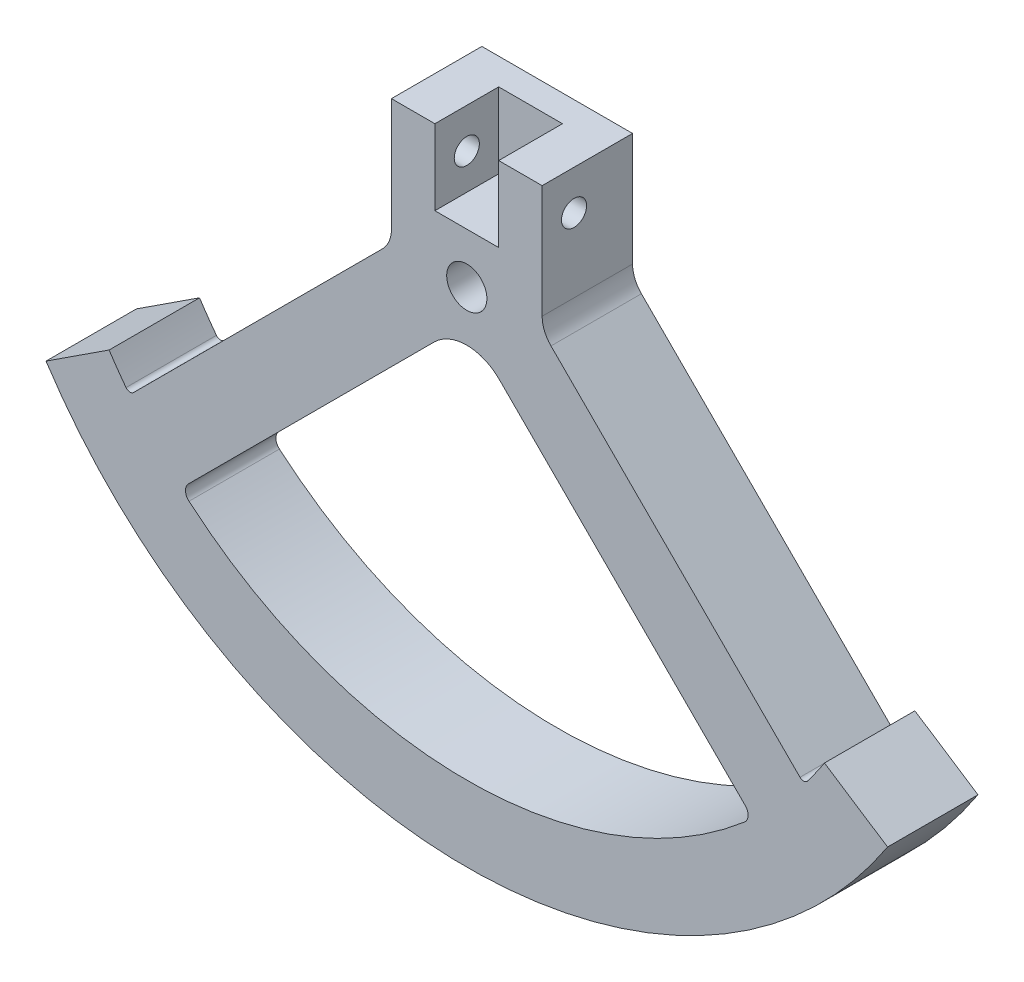
ISO-10303-21;
HEADER;
FILE_DESCRIPTION(('STEP AP214'),'2;1');
FILE_NAME('part.step','',(''),(''),'','','');
FILE_SCHEMA(('AUTOMOTIVE_DESIGN { 1 0 10303 214 1 1 1 1 }'));
ENDSEC;
DATA;
#1=APPLICATION_CONTEXT('core data for automotive mechanical design processes');
#2=APPLICATION_PROTOCOL_DEFINITION('international standard','automotive_design',2000,#1);
#3=PRODUCT_CONTEXT('',#1,'mechanical');
#4=PRODUCT('Part','Part','',(#3));
#5=PRODUCT_RELATED_PRODUCT_CATEGORY('part','',(#4));
#6=PRODUCT_DEFINITION_FORMATION('','',#4);
#7=PRODUCT_DEFINITION_CONTEXT('part definition',#1,'design');
#8=PRODUCT_DEFINITION('design','',#6,#7);
#9=PRODUCT_DEFINITION_SHAPE('','',#8);
#10=(LENGTH_UNIT() NAMED_UNIT(*) SI_UNIT(.MILLI.,.METRE.));
#11=(NAMED_UNIT(*) PLANE_ANGLE_UNIT() SI_UNIT($,.RADIAN.));
#12=(NAMED_UNIT(*) SI_UNIT($,.STERADIAN.) SOLID_ANGLE_UNIT());
#13=UNCERTAINTY_MEASURE_WITH_UNIT(LENGTH_MEASURE(1.E-05),#10,'distance_accuracy_value','');
#14=(GEOMETRIC_REPRESENTATION_CONTEXT(3) GLOBAL_UNCERTAINTY_ASSIGNED_CONTEXT((#13)) GLOBAL_UNIT_ASSIGNED_CONTEXT((#10,
#11,#12)) REPRESENTATION_CONTEXT('',''));
#15=CARTESIAN_POINT('',(0.,0.,0.));
#16=DIRECTION('',(0.,0.,1.));
#17=DIRECTION('',(1.,0.,0.));
#18=AXIS2_PLACEMENT_3D('',#15,#16,#17);
#19=CARTESIAN_POINT('',(0.,0.,18.));
#20=DIRECTION('',(0.,0.,1.));
#21=DIRECTION('',(1.,0.,0.));
#22=AXIS2_PLACEMENT_3D('',#19,#20,#21);
#23=PLANE('',#22);
#24=DIRECTION('',(0.,1.,0.));
#25=VECTOR('',#24,1.);
#26=CARTESIAN_POINT('',(-6.35,10.,18.));
#27=LINE('',#26,#25);
#28=CARTESIAN_POINT('',(-6.35,10.,18.));
#29=VERTEX_POINT('',#28);
#30=CARTESIAN_POINT('',(-6.35,25.,18.));
#31=VERTEX_POINT('',#30);
#32=EDGE_CURVE('E196',#29,#31,#27,.T.);
#33=ORIENTED_EDGE('',*,*,#32,.T.);
#34=DIRECTION('',(-1.,0.,0.));
#35=VECTOR('',#34,1.);
#36=CARTESIAN_POINT('',(15.,25.,18.));
#37=LINE('',#36,#35);
#38=CARTESIAN_POINT('',(-15.,25.,18.));
#39=VERTEX_POINT('',#38);
#40=EDGE_CURVE('E311',#31,#39,#37,.T.);
#41=ORIENTED_EDGE('',*,*,#40,.T.);
#42=DIRECTION('',(0.,-1.,0.));
#43=VECTOR('',#42,1.);
#44=CARTESIAN_POINT('',(-15.,25.,18.));
#45=LINE('',#44,#43);
#46=CARTESIAN_POINT('',(-15.,2.48528137423858,18.));
#47=VERTEX_POINT('',#46);
#48=EDGE_CURVE('E290',#39,#47,#45,.T.);
#49=ORIENTED_EDGE('',*,*,#48,.T.);
#50=CARTESIAN_POINT('',(-21.,2.48528137423858,18.));
#51=DIRECTION('',(0.,0.,1.));
#52=DIRECTION('',(1.,0.,0.));
#53=AXIS2_PLACEMENT_3D('',#50,#51,#52);
#54=CIRCLE('',#53,6.);
#55=CARTESIAN_POINT('',(-16.7573593128807,-1.75735931288072,18.));
#56=VERTEX_POINT('',#55);
#57=EDGE_CURVE('E387',#47,#56,#54,.F.);
#58=ORIENTED_EDGE('',*,*,#57,.T.);
#59=DIRECTION('',(-0.707106781186548,-0.707106781186547,0.));
#60=VECTOR('',#59,1.);
#61=CARTESIAN_POINT('',(-15.,0.,18.));
#62=LINE('',#61,#60);
#63=CARTESIAN_POINT('',(-66.3272334746604,-51.3272334746603,18.));
#64=VERTEX_POINT('',#63);
#65=EDGE_CURVE('E293',#56,#64,#62,.T.);
#66=ORIENTED_EDGE('',*,*,#65,.T.);
#67=CARTESIAN_POINT('',(-67.034340255847,-50.6201266934738,18.));
#68=DIRECTION('',(0.,0.,1.));
#69=DIRECTION('',(1.,0.,0.));
#70=AXIS2_PLACEMENT_3D('',#67,#68,#69);
#71=CIRCLE('',#70,1.);
#72=CARTESIAN_POINT('',(-67.8323681160356,-51.2227472493485,18.));
#73=VERTEX_POINT('',#72);
#74=EDGE_CURVE('E374',#64,#73,#71,.F.);
#75=ORIENTED_EDGE('',*,*,#74,.T.);
#76=CARTESIAN_POINT('',(0.,0.,18.));
#77=DIRECTION('',(0.,0.,-1.));
#78=DIRECTION('',(1.,0.,0.));
#79=AXIS2_PLACEMENT_3D('',#76,#77,#78);
#80=CIRCLE('',#79,85.);
#81=CARTESIAN_POINT('',(-71.1964213926211,-46.4334963241444,18.));
#82=VERTEX_POINT('',#81);
#83=EDGE_CURVE('E296',#73,#82,#80,.T.);
#84=ORIENTED_EDGE('',*,*,#83,.T.);
#85=DIRECTION('',(-0.837604957560248,-0.546276427342875,0.));
#86=VECTOR('',#85,1.);
#87=CARTESIAN_POINT('',(-83.7604957560248,-54.6276427342875,18.));
#88=LINE('',#87,#86);
#89=CARTESIAN_POINT('',(-83.7604957560248,-54.6276427342875,18.));
#90=VERTEX_POINT('',#89);
#91=EDGE_CURVE('E298',#82,#90,#88,.T.);
#92=ORIENTED_EDGE('',*,*,#91,.T.);
#93=CARTESIAN_POINT('',(0.,0.,18.));
#94=DIRECTION('',(0.,0.,1.));
#95=DIRECTION('',(1.,0.,0.));
#96=AXIS2_PLACEMENT_3D('',#93,#94,#95);
#97=CIRCLE('',#96,100.);
#98=CARTESIAN_POINT('',(83.7604957560248,-54.6276427342875,18.));
#99=VERTEX_POINT('',#98);
#100=EDGE_CURVE('E300',#90,#99,#97,.T.);
#101=ORIENTED_EDGE('',*,*,#100,.T.);
#102=DIRECTION('',(-0.837604957560248,0.546276427342875,0.));
#103=VECTOR('',#102,1.);
#104=CARTESIAN_POINT('',(83.7604957560248,-54.6276427342875,18.));
#105=LINE('',#104,#103);
#106=CARTESIAN_POINT('',(71.1964213926211,-46.4334963241444,18.));
#107=VERTEX_POINT('',#106);
#108=EDGE_CURVE('E302',#99,#107,#105,.T.);
#109=ORIENTED_EDGE('',*,*,#108,.T.);
#110=CARTESIAN_POINT('',(0.,0.,18.));
#111=DIRECTION('',(0.,0.,-1.));
#112=DIRECTION('',(-1.,0.,0.));
#113=AXIS2_PLACEMENT_3D('',#110,#111,#112);
#114=CIRCLE('',#113,85.);
#115=CARTESIAN_POINT('',(67.8323681160357,-51.2227472493484,18.));
#116=VERTEX_POINT('',#115);
#117=EDGE_CURVE('E304',#107,#116,#114,.T.);
#118=ORIENTED_EDGE('',*,*,#117,.T.);
#119=CARTESIAN_POINT('',(67.034340255847,-50.6201266934738,18.));
#120=DIRECTION('',(0.,0.,1.));
#121=DIRECTION('',(1.,0.,0.));
#122=AXIS2_PLACEMENT_3D('',#119,#120,#121);
#123=CIRCLE('',#122,1.);
#124=CARTESIAN_POINT('',(66.3272334746604,-51.3272334746603,18.));
#125=VERTEX_POINT('',#124);
#126=EDGE_CURVE('E369',#116,#125,#123,.F.);
#127=ORIENTED_EDGE('',*,*,#126,.T.);
#128=DIRECTION('',(-0.707106781186548,0.707106781186547,0.));
#129=VECTOR('',#128,1.);
#130=CARTESIAN_POINT('',(15.,0.,18.));
#131=LINE('',#130,#129);
#132=CARTESIAN_POINT('',(16.7573593128807,-1.75735931288071,18.));
#133=VERTEX_POINT('',#132);
#134=EDGE_CURVE('E307',#125,#133,#131,.T.);
#135=ORIENTED_EDGE('',*,*,#134,.T.);
#136=CARTESIAN_POINT('',(21.,2.48528137423858,18.));
#137=DIRECTION('',(0.,0.,1.));
#138=DIRECTION('',(1.,0.,0.));
#139=AXIS2_PLACEMENT_3D('',#136,#137,#138);
#140=CIRCLE('',#139,6.);
#141=CARTESIAN_POINT('',(15.,2.48528137423858,18.));
#142=VERTEX_POINT('',#141);
#143=EDGE_CURVE('E11',#133,#142,#140,.F.);
#144=ORIENTED_EDGE('',*,*,#143,.T.);
#145=DIRECTION('',(0.,1.,0.));
#146=VECTOR('',#145,1.);
#147=CARTESIAN_POINT('',(15.,25.,18.));
#148=LINE('',#147,#146);
#149=CARTESIAN_POINT('',(15.,25.,18.));
#150=VERTEX_POINT('',#149);
#151=EDGE_CURVE('E309',#142,#150,#148,.T.);
#152=ORIENTED_EDGE('',*,*,#151,.T.);
#153=CARTESIAN_POINT('',(6.35,25.,18.));
#154=VERTEX_POINT('',#153);
#155=EDGE_CURVE('E312',#150,#154,#37,.T.);
#156=ORIENTED_EDGE('',*,*,#155,.T.);
#157=DIRECTION('',(0.,1.,0.));
#158=VECTOR('',#157,1.);
#159=CARTESIAN_POINT('',(6.35,10.,18.));
#160=LINE('',#159,#158);
#161=CARTESIAN_POINT('',(6.35,10.,18.));
#162=VERTEX_POINT('',#161);
#163=EDGE_CURVE('E206',#162,#154,#160,.T.);
#164=ORIENTED_EDGE('',*,*,#163,.F.);
#165=DIRECTION('',(1.,0.,0.));
#166=VECTOR('',#165,1.);
#167=CARTESIAN_POINT('',(6.35,10.,18.));
#168=LINE('',#167,#166);
#169=EDGE_CURVE('E213',#29,#162,#168,.T.);
#170=ORIENTED_EDGE('',*,*,#169,.F.);
#171=EDGE_LOOP('',(#33,#41,#49,#58,#66,#75,#84,#92,#101,#109,#118,#127,#135,#144,#152,#156,#164,#170));
#172=FACE_BOUND('',#171,.T.);
#173=CARTESIAN_POINT('',(0.,0.,18.));
#174=DIRECTION('',(0.,0.,1.));
#175=DIRECTION('',(1.,0.,0.));
#176=AXIS2_PLACEMENT_3D('',#173,#174,#175);
#177=CIRCLE('',#176,4.);
#178=CARTESIAN_POINT('',(4.,0.,18.));
#179=VERTEX_POINT('',#178);
#180=EDGE_CURVE('E284',#179,#179,#177,.T.);
#181=ORIENTED_EDGE('',*,*,#180,.F.);
#182=EDGE_LOOP('',(#181));
#183=FACE_BOUND('',#182,.T.);
#184=DIRECTION('',(-0.707106781186548,-0.707106781186546,0.));
#185=VECTOR('',#184,1.);
#186=CARTESIAN_POINT('',(-55.4088853706861,-61.6220888062824,18.));
#187=LINE('',#186,#185);
#188=CARTESIAN_POINT('',(-6.46446609406721,-12.6776695296637,18.));
#189=VERTEX_POINT('',#188);
#190=CARTESIAN_POINT('',(-55.4088853706861,-61.6220888062824,18.));
#191=VERTEX_POINT('',#190);
#192=EDGE_CURVE('E241',#189,#191,#187,.T.);
#193=ORIENTED_EDGE('',*,*,#192,.F.);
#194=CARTESIAN_POINT('',(0.,-19.1421356237309,18.));
#195=DIRECTION('',(0.,0.,1.));
#196=DIRECTION('',(-1.,0.,0.));
#197=AXIS2_PLACEMENT_3D('',#194,#195,#196);
#198=CIRCLE('',#197,9.1421356237309);
#199=CARTESIAN_POINT('',(6.46446609406723,-12.6776695296637,18.));
#200=VERTEX_POINT('',#199);
#201=EDGE_CURVE('E239',#200,#189,#198,.T.);
#202=ORIENTED_EDGE('',*,*,#201,.F.);
#203=DIRECTION('',(-0.707106781186549,0.707106781186546,0.));
#204=VECTOR('',#203,1.);
#205=CARTESIAN_POINT('',(55.4088853706861,-61.6220888062824,18.));
#206=LINE('',#205,#204);
#207=CARTESIAN_POINT('',(55.4088853706861,-61.6220888062824,18.));
#208=VERTEX_POINT('',#207);
#209=EDGE_CURVE('E251',#208,#200,#206,.T.);
#210=ORIENTED_EDGE('',*,*,#209,.F.);
#211=CARTESIAN_POINT('',(53.9946718083131,-63.0363023686555,18.));
#212=DIRECTION('',(0.,0.,1.));
#213=DIRECTION('',(1.,0.,0.));
#214=AXIS2_PLACEMENT_3D('',#211,#212,#213);
#215=CIRCLE('',#214,1.99999999999999);
#216=CARTESIAN_POINT('',(55.2957482374291,-64.5552494136833,18.));
#217=VERTEX_POINT('',#216);
#218=EDGE_CURVE('E248',#217,#208,#215,.T.);
#219=ORIENTED_EDGE('',*,*,#218,.F.);
#220=CARTESIAN_POINT('',(0.,0.,18.));
#221=DIRECTION('',(0.,0.,1.));
#222=DIRECTION('',(-1.,0.,0.));
#223=AXIS2_PLACEMENT_3D('',#220,#221,#222);
#224=CIRCLE('',#223,85.);
#225=CARTESIAN_POINT('',(-55.295748237429,-64.5552494136833,18.));
#226=VERTEX_POINT('',#225);
#227=EDGE_CURVE('E246',#226,#217,#224,.T.);
#228=ORIENTED_EDGE('',*,*,#227,.F.);
#229=CARTESIAN_POINT('',(-53.994671808313,-63.0363023686555,18.));
#230=DIRECTION('',(0.,0.,1.));
#231=DIRECTION('',(-1.,0.,0.));
#232=AXIS2_PLACEMENT_3D('',#229,#230,#231);
#233=CIRCLE('',#232,1.99999999999999);
#234=EDGE_CURVE('E244',#191,#226,#233,.T.);
#235=ORIENTED_EDGE('',*,*,#234,.F.);
#236=EDGE_LOOP('',(#193,#202,#210,#219,#228,#235));
#237=FACE_BOUND('',#236,.T.);
#238=ADVANCED_FACE('F35',(#172,#183,#237),#23,.T.);
#239=CARTESIAN_POINT('',(0.,0.,0.));
#240=DIRECTION('',(0.,0.,1.));
#241=DIRECTION('',(1.,0.,0.));
#242=AXIS2_PLACEMENT_3D('',#239,#240,#241);
#243=PLANE('',#242);
#244=CARTESIAN_POINT('',(0.,0.,0.));
#245=DIRECTION('',(0.,0.,1.));
#246=DIRECTION('',(1.,0.,0.));
#247=AXIS2_PLACEMENT_3D('',#244,#245,#246);
#248=CIRCLE('',#247,4.);
#249=CARTESIAN_POINT('',(4.,0.,0.));
#250=VERTEX_POINT('',#249);
#251=EDGE_CURVE('E283',#250,#250,#248,.T.);
#252=ORIENTED_EDGE('',*,*,#251,.T.);
#253=EDGE_LOOP('',(#252));
#254=FACE_BOUND('',#253,.T.);
#255=DIRECTION('',(0.,-1.,0.));
#256=VECTOR('',#255,1.);
#257=CARTESIAN_POINT('',(-15.,25.,0.));
#258=LINE('',#257,#256);
#259=CARTESIAN_POINT('',(-15.,25.,0.));
#260=VERTEX_POINT('',#259);
#261=CARTESIAN_POINT('',(-15.,2.48528137423858,0.));
#262=VERTEX_POINT('',#261);
#263=EDGE_CURVE('E287',#260,#262,#258,.T.);
#264=ORIENTED_EDGE('',*,*,#263,.F.);
#265=DIRECTION('',(-1.,0.,0.));
#266=VECTOR('',#265,1.);
#267=CARTESIAN_POINT('',(15.,25.,0.));
#268=LINE('',#267,#266);
#269=CARTESIAN_POINT('',(15.,25.,0.));
#270=VERTEX_POINT('',#269);
#271=EDGE_CURVE('E294',#270,#260,#268,.T.);
#272=ORIENTED_EDGE('',*,*,#271,.F.);
#273=DIRECTION('',(0.,1.,0.));
#274=VECTOR('',#273,1.);
#275=CARTESIAN_POINT('',(15.,25.,0.));
#276=LINE('',#275,#274);
#277=CARTESIAN_POINT('',(15.,2.48528137423858,0.));
#278=VERTEX_POINT('',#277);
#279=EDGE_CURVE('E332',#278,#270,#276,.T.);
#280=ORIENTED_EDGE('',*,*,#279,.F.);
#281=CARTESIAN_POINT('',(21.,2.48528137423858,0.));
#282=DIRECTION('',(0.,0.,1.));
#283=DIRECTION('',(1.,0.,0.));
#284=AXIS2_PLACEMENT_3D('',#281,#282,#283);
#285=CIRCLE('',#284,6.);
#286=CARTESIAN_POINT('',(16.7573593128807,-1.75735931288071,0.));
#287=VERTEX_POINT('',#286);
#288=EDGE_CURVE('E43',#278,#287,#285,.T.);
#289=ORIENTED_EDGE('',*,*,#288,.T.);
#290=DIRECTION('',(-0.707106781186548,0.707106781186547,0.));
#291=VECTOR('',#290,1.);
#292=CARTESIAN_POINT('',(15.,0.,0.));
#293=LINE('',#292,#291);
#294=CARTESIAN_POINT('',(66.3272334746604,-51.3272334746603,0.));
#295=VERTEX_POINT('',#294);
#296=EDGE_CURVE('E330',#295,#287,#293,.T.);
#297=ORIENTED_EDGE('',*,*,#296,.F.);
#298=CARTESIAN_POINT('',(67.034340255847,-50.6201266934738,0.));
#299=DIRECTION('',(0.,0.,1.));
#300=DIRECTION('',(1.,0.,0.));
#301=AXIS2_PLACEMENT_3D('',#298,#299,#300);
#302=CIRCLE('',#301,1.);
#303=CARTESIAN_POINT('',(67.8323681160357,-51.2227472493484,0.));
#304=VERTEX_POINT('',#303);
#305=EDGE_CURVE('E367',#295,#304,#302,.T.);
#306=ORIENTED_EDGE('',*,*,#305,.T.);
#307=CARTESIAN_POINT('',(0.,0.,0.));
#308=DIRECTION('',(0.,0.,-1.));
#309=DIRECTION('',(-1.,0.,0.));
#310=AXIS2_PLACEMENT_3D('',#307,#308,#309);
#311=CIRCLE('',#310,85.);
#312=CARTESIAN_POINT('',(71.1964213926211,-46.4334963241444,0.));
#313=VERTEX_POINT('',#312);
#314=EDGE_CURVE('E327',#313,#304,#311,.T.);
#315=ORIENTED_EDGE('',*,*,#314,.F.);
#316=DIRECTION('',(-0.837604957560248,0.546276427342875,0.));
#317=VECTOR('',#316,1.);
#318=CARTESIAN_POINT('',(83.7604957560248,-54.6276427342875,0.));
#319=LINE('',#318,#317);
#320=CARTESIAN_POINT('',(83.7604957560248,-54.6276427342875,0.));
#321=VERTEX_POINT('',#320);
#322=EDGE_CURVE('E325',#321,#313,#319,.T.);
#323=ORIENTED_EDGE('',*,*,#322,.F.);
#324=CARTESIAN_POINT('',(0.,0.,0.));
#325=DIRECTION('',(0.,0.,1.));
#326=DIRECTION('',(1.,0.,0.));
#327=AXIS2_PLACEMENT_3D('',#324,#325,#326);
#328=CIRCLE('',#327,100.);
#329=CARTESIAN_POINT('',(-83.7604957560248,-54.6276427342875,0.));
#330=VERTEX_POINT('',#329);
#331=EDGE_CURVE('E323',#330,#321,#328,.T.);
#332=ORIENTED_EDGE('',*,*,#331,.F.);
#333=DIRECTION('',(-0.837604957560248,-0.546276427342875,0.));
#334=VECTOR('',#333,1.);
#335=CARTESIAN_POINT('',(-83.7604957560248,-54.6276427342875,0.));
#336=LINE('',#335,#334);
#337=CARTESIAN_POINT('',(-71.1964213926211,-46.4334963241444,0.));
#338=VERTEX_POINT('',#337);
#339=EDGE_CURVE('E321',#338,#330,#336,.T.);
#340=ORIENTED_EDGE('',*,*,#339,.F.);
#341=CARTESIAN_POINT('',(0.,0.,0.));
#342=DIRECTION('',(0.,0.,-1.));
#343=DIRECTION('',(1.,0.,0.));
#344=AXIS2_PLACEMENT_3D('',#341,#342,#343);
#345=CIRCLE('',#344,85.);
#346=CARTESIAN_POINT('',(-67.8323681160356,-51.2227472493485,0.));
#347=VERTEX_POINT('',#346);
#348=EDGE_CURVE('E319',#347,#338,#345,.T.);
#349=ORIENTED_EDGE('',*,*,#348,.F.);
#350=CARTESIAN_POINT('',(-67.034340255847,-50.6201266934738,0.));
#351=DIRECTION('',(0.,0.,1.));
#352=DIRECTION('',(1.,0.,0.));
#353=AXIS2_PLACEMENT_3D('',#350,#351,#352);
#354=CIRCLE('',#353,1.);
#355=CARTESIAN_POINT('',(-66.3272334746604,-51.3272334746603,0.));
#356=VERTEX_POINT('',#355);
#357=EDGE_CURVE('E371',#347,#356,#354,.T.);
#358=ORIENTED_EDGE('',*,*,#357,.T.);
#359=DIRECTION('',(-0.707106781186548,-0.707106781186547,0.));
#360=VECTOR('',#359,1.);
#361=CARTESIAN_POINT('',(-15.,0.,0.));
#362=LINE('',#361,#360);
#363=CARTESIAN_POINT('',(-16.7573593128807,-1.75735931288072,0.));
#364=VERTEX_POINT('',#363);
#365=EDGE_CURVE('E317',#364,#356,#362,.T.);
#366=ORIENTED_EDGE('',*,*,#365,.F.);
#367=CARTESIAN_POINT('',(-21.,2.48528137423858,0.));
#368=DIRECTION('',(0.,0.,1.));
#369=DIRECTION('',(1.,0.,0.));
#370=AXIS2_PLACEMENT_3D('',#367,#368,#369);
#371=CIRCLE('',#370,6.);
#372=EDGE_CURVE('E385',#364,#262,#371,.T.);
#373=ORIENTED_EDGE('',*,*,#372,.T.);
#374=EDGE_LOOP('',(#264,#272,#280,#289,#297,#306,#315,#323,#332,#340,#349,#358,#366,#373));
#375=FACE_BOUND('',#374,.T.);
#376=CARTESIAN_POINT('',(0.,-19.1421356237309,0.));
#377=DIRECTION('',(0.,0.,1.));
#378=DIRECTION('',(-1.,0.,0.));
#379=AXIS2_PLACEMENT_3D('',#376,#377,#378);
#380=CIRCLE('',#379,9.1421356237309);
#381=CARTESIAN_POINT('',(6.46446609406724,-12.6776695296637,0.));
#382=VERTEX_POINT('',#381);
#383=CARTESIAN_POINT('',(-6.46446609406721,-12.6776695296637,0.));
#384=VERTEX_POINT('',#383);
#385=EDGE_CURVE('E235',#382,#384,#380,.T.);
#386=ORIENTED_EDGE('',*,*,#385,.T.);
#387=DIRECTION('',(-0.707106781186548,-0.707106781186546,0.));
#388=VECTOR('',#387,1.);
#389=CARTESIAN_POINT('',(-55.4088853706861,-61.6220888062824,0.));
#390=LINE('',#389,#388);
#391=CARTESIAN_POINT('',(-55.4088853706861,-61.6220888062824,0.));
#392=VERTEX_POINT('',#391);
#393=EDGE_CURVE('E256',#384,#392,#390,.T.);
#394=ORIENTED_EDGE('',*,*,#393,.T.);
#395=CARTESIAN_POINT('',(-53.994671808313,-63.0363023686555,0.));
#396=DIRECTION('',(0.,0.,1.));
#397=DIRECTION('',(-1.,0.,0.));
#398=AXIS2_PLACEMENT_3D('',#395,#396,#397);
#399=CIRCLE('',#398,1.99999999999999);
#400=CARTESIAN_POINT('',(-55.295748237429,-64.5552494136833,0.));
#401=VERTEX_POINT('',#400);
#402=EDGE_CURVE('E259',#392,#401,#399,.T.);
#403=ORIENTED_EDGE('',*,*,#402,.T.);
#404=CARTESIAN_POINT('',(0.,0.,0.));
#405=DIRECTION('',(0.,0.,1.));
#406=DIRECTION('',(-1.,0.,0.));
#407=AXIS2_PLACEMENT_3D('',#404,#405,#406);
#408=CIRCLE('',#407,85.);
#409=CARTESIAN_POINT('',(55.2957482374291,-64.5552494136833,0.));
#410=VERTEX_POINT('',#409);
#411=EDGE_CURVE('E262',#401,#410,#408,.T.);
#412=ORIENTED_EDGE('',*,*,#411,.T.);
#413=CARTESIAN_POINT('',(53.9946718083131,-63.0363023686555,0.));
#414=DIRECTION('',(0.,0.,1.));
#415=DIRECTION('',(1.,0.,0.));
#416=AXIS2_PLACEMENT_3D('',#413,#414,#415);
#417=CIRCLE('',#416,1.99999999999999);
#418=CARTESIAN_POINT('',(55.4088853706861,-61.6220888062824,0.));
#419=VERTEX_POINT('',#418);
#420=EDGE_CURVE('E265',#410,#419,#417,.T.);
#421=ORIENTED_EDGE('',*,*,#420,.T.);
#422=DIRECTION('',(-0.707106781186549,0.707106781186546,0.));
#423=VECTOR('',#422,1.);
#424=CARTESIAN_POINT('',(55.4088853706861,-61.6220888062824,0.));
#425=LINE('',#424,#423);
#426=EDGE_CURVE('E242',#419,#382,#425,.T.);
#427=ORIENTED_EDGE('',*,*,#426,.T.);
#428=EDGE_LOOP('',(#386,#394,#403,#412,#421,#427));
#429=FACE_BOUND('',#428,.T.);
#430=ADVANCED_FACE('F401',(#254,#375,#429),#243,.F.);
#431=CARTESIAN_POINT('',(-15.,25.,18.));
#432=DIRECTION('',(1.,0.,0.));
#433=DIRECTION('',(0.,1.,0.));
#434=AXIS2_PLACEMENT_3D('',#431,#432,#433);
#435=PLANE('',#434);
#436=CARTESIAN_POINT('',(-15.,17.125,11.65));
#437=DIRECTION('',(-1.,0.,0.));
#438=DIRECTION('',(0.,0.,1.));
#439=AXIS2_PLACEMENT_3D('',#436,#437,#438);
#440=CIRCLE('',#439,2.5);
#441=CARTESIAN_POINT('',(-15.,17.125,14.15));
#442=VERTEX_POINT('',#441);
#443=EDGE_CURVE('E494',#442,#442,#440,.T.);
#444=ORIENTED_EDGE('',*,*,#443,.F.);
#445=EDGE_LOOP('',(#444));
#446=FACE_BOUND('',#445,.T.);
#447=ORIENTED_EDGE('',*,*,#263,.T.);
#448=DIRECTION('',(0.,0.,-1.));
#449=VECTOR('',#448,1.);
#450=CARTESIAN_POINT('',(-15.,2.48528137423858,18.));
#451=LINE('',#450,#449);
#452=EDGE_CURVE('E379',#262,#47,#451,.F.);
#453=ORIENTED_EDGE('',*,*,#452,.T.);
#454=ORIENTED_EDGE('',*,*,#48,.F.);
#455=DIRECTION('',(0.,0.,-1.));
#456=VECTOR('',#455,1.);
#457=CARTESIAN_POINT('',(-15.,25.,18.));
#458=LINE('',#457,#456);
#459=EDGE_CURVE('E314',#39,#260,#458,.T.);
#460=ORIENTED_EDGE('',*,*,#459,.T.);
#461=EDGE_LOOP('',(#447,#453,#454,#460));
#462=FACE_BOUND('',#461,.T.);
#463=ADVANCED_FACE('F405',(#446,#462),#435,.F.);
#464=CARTESIAN_POINT('',(-15.,0.,18.));
#465=DIRECTION('',(0.707106781186547,-0.707106781186548,0.));
#466=DIRECTION('',(0.707106781186548,0.707106781186547,0.));
#467=AXIS2_PLACEMENT_3D('',#464,#465,#466);
#468=PLANE('',#467);
#469=ORIENTED_EDGE('',*,*,#65,.F.);
#470=DIRECTION('',(0.,0.,-1.));
#471=VECTOR('',#470,1.);
#472=CARTESIAN_POINT('',(-16.7573593128807,-1.75735931288072,0.));
#473=LINE('',#472,#471);
#474=EDGE_CURVE('E376',#56,#364,#473,.T.);
#475=ORIENTED_EDGE('',*,*,#474,.T.);
#476=ORIENTED_EDGE('',*,*,#365,.T.);
#477=DIRECTION('',(0.,0.,1.));
#478=VECTOR('',#477,1.);
#479=CARTESIAN_POINT('',(-66.3272334746604,-51.3272334746603,18.));
#480=LINE('',#479,#478);
#481=EDGE_CURVE('E364',#356,#64,#480,.T.);
#482=ORIENTED_EDGE('',*,*,#481,.T.);
#483=EDGE_LOOP('',(#469,#475,#476,#482));
#484=FACE_BOUND('',#483,.T.);
#485=ADVANCED_FACE('F395',(#484),#468,.F.);
#486=CARTESIAN_POINT('',(0.,0.,18.));
#487=DIRECTION('',(0.,0.,-1.));
#488=DIRECTION('',(-1.,0.,0.));
#489=AXIS2_PLACEMENT_3D('',#486,#487,#488);
#490=CYLINDRICAL_SURFACE('',#489,85.);
#491=ORIENTED_EDGE('',*,*,#83,.F.);
#492=DIRECTION('',(0.,0.,-1.));
#493=VECTOR('',#492,1.);
#494=CARTESIAN_POINT('',(-67.8323681160356,-51.2227472493485,18.));
#495=LINE('',#494,#493);
#496=EDGE_CURVE('E361',#73,#347,#495,.T.);
#497=ORIENTED_EDGE('',*,*,#496,.T.);
#498=ORIENTED_EDGE('',*,*,#348,.T.);
#499=DIRECTION('',(0.,0.,-1.));
#500=VECTOR('',#499,1.);
#501=CARTESIAN_POINT('',(-71.1964213926211,-46.4334963241444,18.));
#502=LINE('',#501,#500);
#503=EDGE_CURVE('E349',#82,#338,#502,.T.);
#504=ORIENTED_EDGE('',*,*,#503,.F.);
#505=EDGE_LOOP('',(#491,#497,#498,#504));
#506=FACE_BOUND('',#505,.T.);
#507=ADVANCED_FACE('F446',(#506),#490,.F.);
#508=CARTESIAN_POINT('',(-83.7604957560248,-54.6276427342875,18.));
#509=DIRECTION('',(0.546276427342875,-0.837604957560248,0.));
#510=DIRECTION('',(0.837604957560248,0.546276427342875,0.));
#511=AXIS2_PLACEMENT_3D('',#508,#509,#510);
#512=PLANE('',#511);
#513=ORIENTED_EDGE('',*,*,#339,.T.);
#514=DIRECTION('',(0.,0.,-1.));
#515=VECTOR('',#514,1.);
#516=CARTESIAN_POINT('',(-83.7604957560248,-54.6276427342875,18.));
#517=LINE('',#516,#515);
#518=EDGE_CURVE('E346',#90,#330,#517,.T.);
#519=ORIENTED_EDGE('',*,*,#518,.F.);
#520=ORIENTED_EDGE('',*,*,#91,.F.);
#521=ORIENTED_EDGE('',*,*,#503,.T.);
#522=EDGE_LOOP('',(#513,#519,#520,#521));
#523=FACE_BOUND('',#522,.T.);
#524=ADVANCED_FACE('F442',(#523),#512,.F.);
#525=CARTESIAN_POINT('',(0.,0.,18.));
#526=DIRECTION('',(0.,0.,-1.));
#527=DIRECTION('',(-1.,0.,0.));
#528=AXIS2_PLACEMENT_3D('',#525,#526,#527);
#529=CYLINDRICAL_SURFACE('',#528,100.);
#530=ORIENTED_EDGE('',*,*,#331,.T.);
#531=DIRECTION('',(0.,0.,-1.));
#532=VECTOR('',#531,1.);
#533=CARTESIAN_POINT('',(83.7604957560248,-54.6276427342875,18.));
#534=LINE('',#533,#532);
#535=EDGE_CURVE('E343',#99,#321,#534,.T.);
#536=ORIENTED_EDGE('',*,*,#535,.F.);
#537=ORIENTED_EDGE('',*,*,#100,.F.);
#538=ORIENTED_EDGE('',*,*,#518,.T.);
#539=EDGE_LOOP('',(#530,#536,#537,#538));
#540=FACE_BOUND('',#539,.T.);
#541=ADVANCED_FACE('F437',(#540),#529,.T.);
#542=CARTESIAN_POINT('',(83.7604957560248,-54.6276427342875,18.));
#543=DIRECTION('',(-0.546276427342875,-0.837604957560248,0.));
#544=DIRECTION('',(0.837604957560248,-0.546276427342875,0.));
#545=AXIS2_PLACEMENT_3D('',#542,#543,#544);
#546=PLANE('',#545);
#547=ORIENTED_EDGE('',*,*,#322,.T.);
#548=DIRECTION('',(0.,0.,-1.));
#549=VECTOR('',#548,1.);
#550=CARTESIAN_POINT('',(71.1964213926211,-46.4334963241444,18.));
#551=LINE('',#550,#549);
#552=EDGE_CURVE('E340',#107,#313,#551,.T.);
#553=ORIENTED_EDGE('',*,*,#552,.F.);
#554=ORIENTED_EDGE('',*,*,#108,.F.);
#555=ORIENTED_EDGE('',*,*,#535,.T.);
#556=EDGE_LOOP('',(#547,#553,#554,#555));
#557=FACE_BOUND('',#556,.T.);
#558=ADVANCED_FACE('F431',(#557),#546,.F.);
#559=CARTESIAN_POINT('',(0.,0.,18.));
#560=DIRECTION('',(0.,0.,-1.));
#561=DIRECTION('',(-1.,0.,0.));
#562=AXIS2_PLACEMENT_3D('',#559,#560,#561);
#563=CYLINDRICAL_SURFACE('',#562,85.);
#564=ORIENTED_EDGE('',*,*,#314,.T.);
#565=DIRECTION('',(0.,0.,-1.));
#566=VECTOR('',#565,1.);
#567=CARTESIAN_POINT('',(67.8323681160357,-51.2227472493484,18.));
#568=LINE('',#567,#566);
#569=EDGE_CURVE('E359',#304,#116,#568,.F.);
#570=ORIENTED_EDGE('',*,*,#569,.T.);
#571=ORIENTED_EDGE('',*,*,#117,.F.);
#572=ORIENTED_EDGE('',*,*,#552,.T.);
#573=EDGE_LOOP('',(#564,#570,#571,#572));
#574=FACE_BOUND('',#573,.T.);
#575=ADVANCED_FACE('F426',(#574),#563,.F.);
#576=CARTESIAN_POINT('',(15.,0.,18.));
#577=DIRECTION('',(-0.707106781186547,-0.707106781186548,0.));
#578=DIRECTION('',(0.707106781186548,-0.707106781186547,0.));
#579=AXIS2_PLACEMENT_3D('',#576,#577,#578);
#580=PLANE('',#579);
#581=ORIENTED_EDGE('',*,*,#296,.T.);
#582=DIRECTION('',(0.,0.,-1.));
#583=VECTOR('',#582,1.);
#584=CARTESIAN_POINT('',(16.7573593128807,-1.75735931288071,18.));
#585=LINE('',#584,#583);
#586=EDGE_CURVE('E56',#287,#133,#585,.F.);
#587=ORIENTED_EDGE('',*,*,#586,.T.);
#588=ORIENTED_EDGE('',*,*,#134,.F.);
#589=DIRECTION('',(0.,0.,1.));
#590=VECTOR('',#589,1.);
#591=CARTESIAN_POINT('',(66.3272334746604,-51.3272334746603,0.));
#592=LINE('',#591,#590);
#593=EDGE_CURVE('E352',#125,#295,#592,.F.);
#594=ORIENTED_EDGE('',*,*,#593,.T.);
#595=EDGE_LOOP('',(#581,#587,#588,#594));
#596=FACE_BOUND('',#595,.T.);
#597=ADVANCED_FACE('F419',(#596),#580,.F.);
#598=CARTESIAN_POINT('',(15.,25.,18.));
#599=DIRECTION('',(-1.,0.,0.));
#600=DIRECTION('',(0.,-1.,0.));
#601=AXIS2_PLACEMENT_3D('',#598,#599,#600);
#602=PLANE('',#601);
#603=CARTESIAN_POINT('',(15.,17.125,11.65));
#604=DIRECTION('',(-1.,0.,0.));
#605=DIRECTION('',(0.,-1.,0.));
#606=AXIS2_PLACEMENT_3D('',#603,#604,#605);
#607=CIRCLE('',#606,2.5);
#608=CARTESIAN_POINT('',(15.,14.625,11.65));
#609=VERTEX_POINT('',#608);
#610=EDGE_CURVE('E356',#609,#609,#607,.F.);
#611=ORIENTED_EDGE('',*,*,#610,.F.);
#612=EDGE_LOOP('',(#611));
#613=FACE_BOUND('',#612,.T.);
#614=ORIENTED_EDGE('',*,*,#151,.F.);
#615=DIRECTION('',(0.,0.,-1.));
#616=VECTOR('',#615,1.);
#617=CARTESIAN_POINT('',(15.,2.48528137423858,0.));
#618=LINE('',#617,#616);
#619=EDGE_CURVE('E381',#142,#278,#618,.T.);
#620=ORIENTED_EDGE('',*,*,#619,.T.);
#621=ORIENTED_EDGE('',*,*,#279,.T.);
#622=DIRECTION('',(0.,0.,-1.));
#623=VECTOR('',#622,1.);
#624=CARTESIAN_POINT('',(15.,25.,18.));
#625=LINE('',#624,#623);
#626=EDGE_CURVE('E337',#150,#270,#625,.T.);
#627=ORIENTED_EDGE('',*,*,#626,.F.);
#628=EDGE_LOOP('',(#614,#620,#621,#627));
#629=FACE_BOUND('',#628,.T.);
#630=ADVANCED_FACE('F413',(#613,#629),#602,.F.);
#631=CARTESIAN_POINT('',(15.,25.,18.));
#632=DIRECTION('',(0.,-1.,0.));
#633=DIRECTION('',(1.,0.,0.));
#634=AXIS2_PLACEMENT_3D('',#631,#632,#633);
#635=PLANE('',#634);
#636=ORIENTED_EDGE('',*,*,#40,.F.);
#637=DIRECTION('',(0.,0.,1.));
#638=VECTOR('',#637,1.);
#639=CARTESIAN_POINT('',(-6.35,25.,5.3));
#640=LINE('',#639,#638);
#641=CARTESIAN_POINT('',(-6.35,25.,5.3));
#642=VERTEX_POINT('',#641);
#643=EDGE_CURVE('E202',#642,#31,#640,.T.);
#644=ORIENTED_EDGE('',*,*,#643,.F.);
#645=DIRECTION('',(-1.,0.,0.));
#646=VECTOR('',#645,1.);
#647=CARTESIAN_POINT('',(6.35,25.,5.3));
#648=LINE('',#647,#646);
#649=CARTESIAN_POINT('',(6.35,25.,5.3));
#650=VERTEX_POINT('',#649);
#651=EDGE_CURVE('E216',#650,#642,#648,.T.);
#652=ORIENTED_EDGE('',*,*,#651,.F.);
#653=DIRECTION('',(0.,0.,-1.));
#654=VECTOR('',#653,1.);
#655=CARTESIAN_POINT('',(6.35,25.,5.3));
#656=LINE('',#655,#654);
#657=EDGE_CURVE('E227',#154,#650,#656,.T.);
#658=ORIENTED_EDGE('',*,*,#657,.F.);
#659=ORIENTED_EDGE('',*,*,#155,.F.);
#660=ORIENTED_EDGE('',*,*,#626,.T.);
#661=ORIENTED_EDGE('',*,*,#271,.T.);
#662=ORIENTED_EDGE('',*,*,#459,.F.);
#663=EDGE_LOOP('',(#636,#644,#652,#658,#659,#660,#661,#662));
#664=FACE_BOUND('',#663,.T.);
#665=ADVANCED_FACE('F408',(#664),#635,.F.);
#666=CARTESIAN_POINT('',(0.,0.,18.));
#667=DIRECTION('',(0.,0.,-1.));
#668=DIRECTION('',(-1.,0.,0.));
#669=AXIS2_PLACEMENT_3D('',#666,#667,#668);
#670=CYLINDRICAL_SURFACE('',#669,4.);
#671=ORIENTED_EDGE('',*,*,#180,.T.);
#672=EDGE_LOOP('',(#671));
#673=FACE_BOUND('',#672,.T.);
#674=ORIENTED_EDGE('',*,*,#251,.F.);
#675=EDGE_LOOP('',(#674));
#676=FACE_BOUND('',#675,.T.);
#677=ADVANCED_FACE('F466',(#673,#676),#670,.F.);
#678=CARTESIAN_POINT('',(0.,-19.1421356237309,18.));
#679=DIRECTION('',(0.,0.,-1.));
#680=DIRECTION('',(-1.,0.,0.));
#681=AXIS2_PLACEMENT_3D('',#678,#679,#680);
#682=CYLINDRICAL_SURFACE('',#681,9.1421356237309);
#683=ORIENTED_EDGE('',*,*,#385,.F.);
#684=DIRECTION('',(0.,0.,-1.));
#685=VECTOR('',#684,1.);
#686=CARTESIAN_POINT('',(6.46446609406723,-12.6776695296637,18.));
#687=LINE('',#686,#685);
#688=EDGE_CURVE('E253',#200,#382,#687,.T.);
#689=ORIENTED_EDGE('',*,*,#688,.F.);
#690=ORIENTED_EDGE('',*,*,#201,.T.);
#691=DIRECTION('',(0.,0.,-1.));
#692=VECTOR('',#691,1.);
#693=CARTESIAN_POINT('',(-6.46446609406721,-12.6776695296637,18.));
#694=LINE('',#693,#692);
#695=EDGE_CURVE('E280',#189,#384,#694,.T.);
#696=ORIENTED_EDGE('',*,*,#695,.T.);
#697=EDGE_LOOP('',(#683,#689,#690,#696));
#698=FACE_BOUND('',#697,.T.);
#699=ADVANCED_FACE('F541',(#698),#682,.F.);
#700=CARTESIAN_POINT('',(-55.4088853706861,-61.6220888062824,18.));
#701=DIRECTION('',(0.707106781186547,-0.707106781186549,0.));
#702=DIRECTION('',(0.707106781186549,0.707106781186547,0.));
#703=AXIS2_PLACEMENT_3D('',#700,#701,#702);
#704=PLANE('',#703);
#705=ORIENTED_EDGE('',*,*,#393,.F.);
#706=ORIENTED_EDGE('',*,*,#695,.F.);
#707=ORIENTED_EDGE('',*,*,#192,.T.);
#708=DIRECTION('',(0.,0.,-1.));
#709=VECTOR('',#708,1.);
#710=CARTESIAN_POINT('',(-55.4088853706861,-61.6220888062824,18.));
#711=LINE('',#710,#709);
#712=EDGE_CURVE('E278',#191,#392,#711,.T.);
#713=ORIENTED_EDGE('',*,*,#712,.T.);
#714=EDGE_LOOP('',(#705,#706,#707,#713));
#715=FACE_BOUND('',#714,.T.);
#716=ADVANCED_FACE('F538',(#715),#704,.T.);
#717=CARTESIAN_POINT('',(-53.994671808313,-63.0363023686555,18.));
#718=DIRECTION('',(0.,0.,-1.));
#719=DIRECTION('',(-1.,0.,0.));
#720=AXIS2_PLACEMENT_3D('',#717,#718,#719);
#721=CYLINDRICAL_SURFACE('',#720,1.99999999999999);
#722=ORIENTED_EDGE('',*,*,#402,.F.);
#723=ORIENTED_EDGE('',*,*,#712,.F.);
#724=ORIENTED_EDGE('',*,*,#234,.T.);
#725=DIRECTION('',(0.,0.,-1.));
#726=VECTOR('',#725,1.);
#727=CARTESIAN_POINT('',(-55.295748237429,-64.5552494136833,18.));
#728=LINE('',#727,#726);
#729=EDGE_CURVE('E276',#226,#401,#728,.T.);
#730=ORIENTED_EDGE('',*,*,#729,.T.);
#731=EDGE_LOOP('',(#722,#723,#724,#730));
#732=FACE_BOUND('',#731,.T.);
#733=ADVANCED_FACE('F534',(#732),#721,.F.);
#734=CARTESIAN_POINT('',(0.,0.,18.));
#735=DIRECTION('',(0.,0.,-1.));
#736=DIRECTION('',(-1.,0.,0.));
#737=AXIS2_PLACEMENT_3D('',#734,#735,#736);
#738=CYLINDRICAL_SURFACE('',#737,85.);
#739=ORIENTED_EDGE('',*,*,#411,.F.);
#740=ORIENTED_EDGE('',*,*,#729,.F.);
#741=ORIENTED_EDGE('',*,*,#227,.T.);
#742=DIRECTION('',(0.,0.,-1.));
#743=VECTOR('',#742,1.);
#744=CARTESIAN_POINT('',(55.2957482374291,-64.5552494136833,18.));
#745=LINE('',#744,#743);
#746=EDGE_CURVE('E274',#217,#410,#745,.T.);
#747=ORIENTED_EDGE('',*,*,#746,.T.);
#748=EDGE_LOOP('',(#739,#740,#741,#747));
#749=FACE_BOUND('',#748,.T.);
#750=ADVANCED_FACE('F530',(#749),#738,.F.);
#751=CARTESIAN_POINT('',(53.9946718083131,-63.0363023686555,18.));
#752=DIRECTION('',(0.,0.,-1.));
#753=DIRECTION('',(-1.,0.,0.));
#754=AXIS2_PLACEMENT_3D('',#751,#752,#753);
#755=CYLINDRICAL_SURFACE('',#754,1.99999999999999);
#756=ORIENTED_EDGE('',*,*,#420,.F.);
#757=ORIENTED_EDGE('',*,*,#746,.F.);
#758=ORIENTED_EDGE('',*,*,#218,.T.);
#759=DIRECTION('',(0.,0.,-1.));
#760=VECTOR('',#759,1.);
#761=CARTESIAN_POINT('',(55.4088853706861,-61.6220888062824,18.));
#762=LINE('',#761,#760);
#763=EDGE_CURVE('E272',#208,#419,#762,.T.);
#764=ORIENTED_EDGE('',*,*,#763,.T.);
#765=EDGE_LOOP('',(#756,#757,#758,#764));
#766=FACE_BOUND('',#765,.T.);
#767=ADVANCED_FACE('F526',(#766),#755,.F.);
#768=CARTESIAN_POINT('',(55.4088853706861,-61.6220888062824,18.));
#769=DIRECTION('',(-0.707106781186546,-0.707106781186549,0.));
#770=DIRECTION('',(0.707106781186549,-0.707106781186546,0.));
#771=AXIS2_PLACEMENT_3D('',#768,#769,#770);
#772=PLANE('',#771);
#773=ORIENTED_EDGE('',*,*,#426,.F.);
#774=ORIENTED_EDGE('',*,*,#763,.F.);
#775=ORIENTED_EDGE('',*,*,#209,.T.);
#776=ORIENTED_EDGE('',*,*,#688,.T.);
#777=EDGE_LOOP('',(#773,#774,#775,#776));
#778=FACE_BOUND('',#777,.T.);
#779=ADVANCED_FACE('F523',(#778),#772,.T.);
#780=CARTESIAN_POINT('',(-6.35,10.,5.3));
#781=DIRECTION('',(-1.,0.,0.));
#782=DIRECTION('',(0.,-1.,0.));
#783=AXIS2_PLACEMENT_3D('',#780,#781,#782);
#784=PLANE('',#783);
#785=CARTESIAN_POINT('',(-6.35,17.125,11.65));
#786=DIRECTION('',(-1.,0.,0.));
#787=DIRECTION('',(0.,-1.,0.));
#788=AXIS2_PLACEMENT_3D('',#785,#786,#787);
#789=CIRCLE('',#788,2.5);
#790=CARTESIAN_POINT('',(-6.35,14.625,11.65));
#791=VERTEX_POINT('',#790);
#792=EDGE_CURVE('E228',#791,#791,#789,.T.);
#793=ORIENTED_EDGE('',*,*,#792,.T.);
#794=EDGE_LOOP('',(#793));
#795=FACE_BOUND('',#794,.T.);
#796=ORIENTED_EDGE('',*,*,#643,.T.);
#797=ORIENTED_EDGE('',*,*,#32,.F.);
#798=DIRECTION('',(0.,0.,1.));
#799=VECTOR('',#798,1.);
#800=CARTESIAN_POINT('',(-6.35,10.,5.3));
#801=LINE('',#800,#799);
#802=CARTESIAN_POINT('',(-6.35,10.,5.3));
#803=VERTEX_POINT('',#802);
#804=EDGE_CURVE('E199',#803,#29,#801,.T.);
#805=ORIENTED_EDGE('',*,*,#804,.F.);
#806=DIRECTION('',(0.,1.,0.));
#807=VECTOR('',#806,1.);
#808=CARTESIAN_POINT('',(-6.35,10.,5.3));
#809=LINE('',#808,#807);
#810=EDGE_CURVE('E233',#803,#642,#809,.T.);
#811=ORIENTED_EDGE('',*,*,#810,.T.);
#812=EDGE_LOOP('',(#796,#797,#805,#811));
#813=FACE_BOUND('',#812,.T.);
#814=ADVANCED_FACE('F198',(#795,#813),#784,.F.);
#815=CARTESIAN_POINT('',(6.35,10.,5.3));
#816=DIRECTION('',(0.,0.,-1.));
#817=DIRECTION('',(-1.,0.,0.));
#818=AXIS2_PLACEMENT_3D('',#815,#816,#817);
#819=PLANE('',#818);
#820=ORIENTED_EDGE('',*,*,#651,.T.);
#821=ORIENTED_EDGE('',*,*,#810,.F.);
#822=DIRECTION('',(-1.,0.,0.));
#823=VECTOR('',#822,1.);
#824=CARTESIAN_POINT('',(6.35,10.,5.3));
#825=LINE('',#824,#823);
#826=CARTESIAN_POINT('',(6.35,10.,5.3));
#827=VERTEX_POINT('',#826);
#828=EDGE_CURVE('E207',#827,#803,#825,.T.);
#829=ORIENTED_EDGE('',*,*,#828,.F.);
#830=DIRECTION('',(0.,1.,0.));
#831=VECTOR('',#830,1.);
#832=CARTESIAN_POINT('',(6.35,10.,5.3));
#833=LINE('',#832,#831);
#834=EDGE_CURVE('E236',#827,#650,#833,.T.);
#835=ORIENTED_EDGE('',*,*,#834,.T.);
#836=EDGE_LOOP('',(#820,#821,#829,#835));
#837=FACE_BOUND('',#836,.T.);
#838=ADVANCED_FACE('F514',(#837),#819,.F.);
#839=CARTESIAN_POINT('',(6.35,10.,5.3));
#840=DIRECTION('',(1.,0.,0.));
#841=DIRECTION('',(0.,1.,0.));
#842=AXIS2_PLACEMENT_3D('',#839,#840,#841);
#843=PLANE('',#842);
#844=CARTESIAN_POINT('',(6.35,17.125,11.65));
#845=DIRECTION('',(1.,0.,0.));
#846=DIRECTION('',(0.,1.,0.));
#847=AXIS2_PLACEMENT_3D('',#844,#845,#846);
#848=CIRCLE('',#847,2.5);
#849=CARTESIAN_POINT('',(6.35,19.625,11.65));
#850=VERTEX_POINT('',#849);
#851=EDGE_CURVE('E353',#850,#850,#848,.T.);
#852=ORIENTED_EDGE('',*,*,#851,.T.);
#853=EDGE_LOOP('',(#852));
#854=FACE_BOUND('',#853,.T.);
#855=ORIENTED_EDGE('',*,*,#657,.T.);
#856=ORIENTED_EDGE('',*,*,#834,.F.);
#857=DIRECTION('',(0.,0.,-1.));
#858=VECTOR('',#857,1.);
#859=CARTESIAN_POINT('',(6.35,10.,5.3));
#860=LINE('',#859,#858);
#861=EDGE_CURVE('E220',#162,#827,#860,.T.);
#862=ORIENTED_EDGE('',*,*,#861,.F.);
#863=ORIENTED_EDGE('',*,*,#163,.T.);
#864=EDGE_LOOP('',(#855,#856,#862,#863));
#865=FACE_BOUND('',#864,.T.);
#866=ADVANCED_FACE('F513',(#854,#865),#843,.F.);
#867=CARTESIAN_POINT('',(0.,10.,0.));
#868=DIRECTION('',(0.,-1.,0.));
#869=DIRECTION('',(0.,0.,-1.));
#870=AXIS2_PLACEMENT_3D('',#867,#868,#869);
#871=PLANE('',#870);
#872=ORIENTED_EDGE('',*,*,#804,.T.);
#873=ORIENTED_EDGE('',*,*,#169,.T.);
#874=ORIENTED_EDGE('',*,*,#861,.T.);
#875=ORIENTED_EDGE('',*,*,#828,.T.);
#876=EDGE_LOOP('',(#872,#873,#874,#875));
#877=FACE_BOUND('',#876,.T.);
#878=ADVANCED_FACE('F211',(#877),#871,.F.);
#879=CARTESIAN_POINT('',(22.0710678118655,17.125,11.65));
#880=DIRECTION('',(-1.,0.,0.));
#881=DIRECTION('',(0.,0.,1.));
#882=AXIS2_PLACEMENT_3D('',#879,#880,#881);
#883=CYLINDRICAL_SURFACE('',#882,2.5);
#884=ORIENTED_EDGE('',*,*,#610,.T.);
#885=EDGE_LOOP('',(#884));
#886=FACE_BOUND('',#885,.T.);
#887=ORIENTED_EDGE('',*,*,#851,.F.);
#888=EDGE_LOOP('',(#887));
#889=FACE_BOUND('',#888,.T.);
#890=ADVANCED_FACE('F504',(#886,#889),#883,.F.);
#891=ORIENTED_EDGE('',*,*,#443,.T.);
#892=EDGE_LOOP('',(#891));
#893=FACE_BOUND('',#892,.T.);
#894=ORIENTED_EDGE('',*,*,#792,.F.);
#895=EDGE_LOOP('',(#894));
#896=FACE_BOUND('',#895,.T.);
#897=ADVANCED_FACE('F456',(#893,#896),#883,.F.);
#898=CARTESIAN_POINT('',(67.034340255847,-50.6201266934738,18.));
#899=DIRECTION('',(0.,0.,-1.));
#900=DIRECTION('',(-1.,0.,0.));
#901=AXIS2_PLACEMENT_3D('',#898,#899,#900);
#902=CYLINDRICAL_SURFACE('',#901,1.);
#903=ORIENTED_EDGE('',*,*,#126,.F.);
#904=ORIENTED_EDGE('',*,*,#569,.F.);
#905=ORIENTED_EDGE('',*,*,#305,.F.);
#906=ORIENTED_EDGE('',*,*,#593,.F.);
#907=EDGE_LOOP('',(#903,#904,#905,#906));
#908=FACE_BOUND('',#907,.T.);
#909=ADVANCED_FACE('F421',(#908),#902,.F.);
#910=CARTESIAN_POINT('',(-67.034340255847,-50.6201266934738,18.));
#911=DIRECTION('',(0.,0.,-1.));
#912=DIRECTION('',(-1.,0.,0.));
#913=AXIS2_PLACEMENT_3D('',#910,#911,#912);
#914=CYLINDRICAL_SURFACE('',#913,1.);
#915=ORIENTED_EDGE('',*,*,#74,.F.);
#916=ORIENTED_EDGE('',*,*,#481,.F.);
#917=ORIENTED_EDGE('',*,*,#357,.F.);
#918=ORIENTED_EDGE('',*,*,#496,.F.);
#919=EDGE_LOOP('',(#915,#916,#917,#918));
#920=FACE_BOUND('',#919,.T.);
#921=ADVANCED_FACE('F449',(#920),#914,.F.);
#922=CARTESIAN_POINT('',(-21.,2.48528137423858,18.));
#923=DIRECTION('',(0.,0.,1.));
#924=DIRECTION('',(1.,0.,0.));
#925=AXIS2_PLACEMENT_3D('',#922,#923,#924);
#926=CYLINDRICAL_SURFACE('',#925,6.);
#927=ORIENTED_EDGE('',*,*,#57,.F.);
#928=ORIENTED_EDGE('',*,*,#452,.F.);
#929=ORIENTED_EDGE('',*,*,#372,.F.);
#930=ORIENTED_EDGE('',*,*,#474,.F.);
#931=EDGE_LOOP('',(#927,#928,#929,#930));
#932=FACE_BOUND('',#931,.T.);
#933=ADVANCED_FACE('F399',(#932),#926,.F.);
#934=CARTESIAN_POINT('',(21.,2.48528137423858,18.));
#935=DIRECTION('',(0.,0.,1.));
#936=DIRECTION('',(1.,0.,0.));
#937=AXIS2_PLACEMENT_3D('',#934,#935,#936);
#938=CYLINDRICAL_SURFACE('',#937,6.);
#939=ORIENTED_EDGE('',*,*,#143,.F.);
#940=ORIENTED_EDGE('',*,*,#586,.F.);
#941=ORIENTED_EDGE('',*,*,#288,.F.);
#942=ORIENTED_EDGE('',*,*,#619,.F.);
#943=EDGE_LOOP('',(#939,#940,#941,#942));
#944=FACE_BOUND('',#943,.T.);
#945=ADVANCED_FACE('F37',(#944),#938,.F.);
#946=CLOSED_SHELL('',(#238,#430,#463,#485,#507,#524,#541,#558,#575,#597,#630,#665,#677,#699,
#716,#733,#750,#767,#779,#814,#838,#866,#878,#890,#897,#909,#921,#933,#945));
#947=MANIFOLD_SOLID_BREP('B2',#946);
#948=ADVANCED_BREP_SHAPE_REPRESENTATION('',(#18,#947),#14);
#949=SHAPE_DEFINITION_REPRESENTATION(#9,#948);
ENDSEC;
END-ISO-10303-21;
